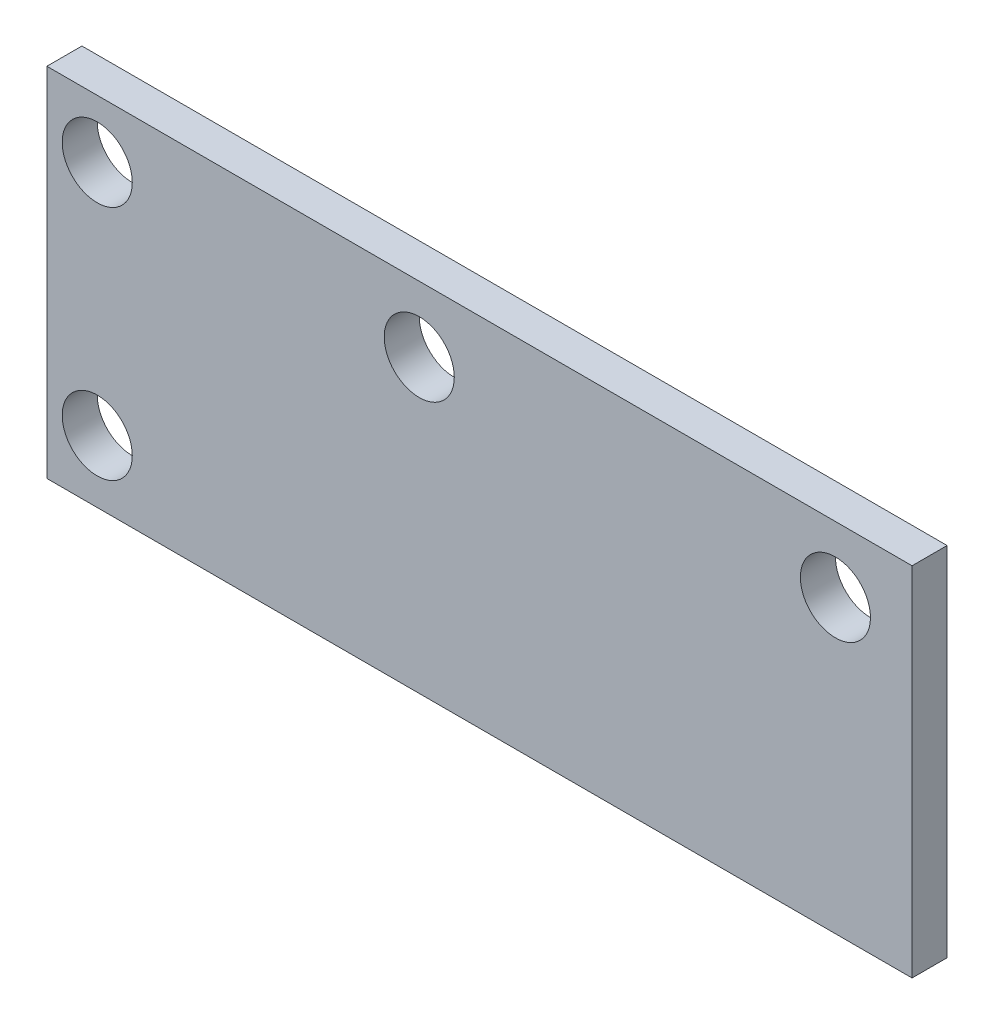
ISO-10303-21;
HEADER;
FILE_DESCRIPTION(('STEP AP214'),'2;1');
FILE_NAME('part.step','',(''),(''),'','','');
FILE_SCHEMA(('AUTOMOTIVE_DESIGN { 1 0 10303 214 1 1 1 1 }'));
ENDSEC;
DATA;
#1=APPLICATION_CONTEXT('core data for automotive mechanical design processes');
#2=APPLICATION_PROTOCOL_DEFINITION('international standard','automotive_design',2000,#1);
#3=PRODUCT_CONTEXT('',#1,'mechanical');
#4=PRODUCT('Part','Part','',(#3));
#5=PRODUCT_RELATED_PRODUCT_CATEGORY('part','',(#4));
#6=PRODUCT_DEFINITION_FORMATION('','',#4);
#7=PRODUCT_DEFINITION_CONTEXT('part definition',#1,'design');
#8=PRODUCT_DEFINITION('design','',#6,#7);
#9=PRODUCT_DEFINITION_SHAPE('','',#8);
#10=(LENGTH_UNIT() NAMED_UNIT(*) SI_UNIT(.MILLI.,.METRE.));
#11=(NAMED_UNIT(*) PLANE_ANGLE_UNIT() SI_UNIT($,.RADIAN.));
#12=(NAMED_UNIT(*) SI_UNIT($,.STERADIAN.) SOLID_ANGLE_UNIT());
#13=UNCERTAINTY_MEASURE_WITH_UNIT(LENGTH_MEASURE(1.E-05),#10,'distance_accuracy_value','');
#14=(GEOMETRIC_REPRESENTATION_CONTEXT(3) GLOBAL_UNCERTAINTY_ASSIGNED_CONTEXT((#13)) GLOBAL_UNIT_ASSIGNED_CONTEXT((#10,
#11,#12)) REPRESENTATION_CONTEXT('',''));
#15=CARTESIAN_POINT('',(0.,0.,0.));
#16=DIRECTION('',(0.,0.,1.));
#17=DIRECTION('',(1.,0.,0.));
#18=AXIS2_PLACEMENT_3D('',#15,#16,#17);
#19=CARTESIAN_POINT('',(19.75,-8.15,1.6));
#20=DIRECTION('',(-1.,0.,0.));
#21=DIRECTION('',(0.,0.,1.));
#22=AXIS2_PLACEMENT_3D('',#19,#20,#21);
#23=PLANE('',#22);
#24=DIRECTION('',(0.,1.,0.));
#25=VECTOR('',#24,1.);
#26=CARTESIAN_POINT('',(19.75,-8.15,0.));
#27=LINE('',#26,#25);
#28=CARTESIAN_POINT('',(19.75,-8.15,0.));
#29=VERTEX_POINT('',#28);
#30=CARTESIAN_POINT('',(19.75,8.15,0.));
#31=VERTEX_POINT('',#30);
#32=EDGE_CURVE('E97',#29,#31,#27,.T.);
#33=ORIENTED_EDGE('',*,*,#32,.T.);
#34=DIRECTION('',(0.,0.,-1.));
#35=VECTOR('',#34,1.);
#36=CARTESIAN_POINT('',(19.75,8.15,1.6));
#37=LINE('',#36,#35);
#38=CARTESIAN_POINT('',(19.75,8.15,1.6));
#39=VERTEX_POINT('',#38);
#40=EDGE_CURVE('E11',#39,#31,#37,.T.);
#41=ORIENTED_EDGE('',*,*,#40,.F.);
#42=DIRECTION('',(0.,1.,0.));
#43=VECTOR('',#42,1.);
#44=CARTESIAN_POINT('',(19.75,-8.15,1.6));
#45=LINE('',#44,#43);
#46=CARTESIAN_POINT('',(19.75,-8.15,1.6));
#47=VERTEX_POINT('',#46);
#48=EDGE_CURVE('E85',#47,#39,#45,.T.);
#49=ORIENTED_EDGE('',*,*,#48,.F.);
#50=DIRECTION('',(0.,0.,-1.));
#51=VECTOR('',#50,1.);
#52=CARTESIAN_POINT('',(19.75,-8.15,1.6));
#53=LINE('',#52,#51);
#54=EDGE_CURVE('E93',#47,#29,#53,.T.);
#55=ORIENTED_EDGE('',*,*,#54,.T.);
#56=EDGE_LOOP('',(#33,#41,#49,#55));
#57=FACE_BOUND('',#56,.T.);
#58=ADVANCED_FACE('F34',(#57),#23,.F.);
#59=CARTESIAN_POINT('',(-19.75,8.15,1.6));
#60=DIRECTION('',(0.,-1.,0.));
#61=DIRECTION('',(0.,0.,-1.));
#62=AXIS2_PLACEMENT_3D('',#59,#60,#61);
#63=PLANE('',#62);
#64=DIRECTION('',(-1.,0.,0.));
#65=VECTOR('',#64,1.);
#66=CARTESIAN_POINT('',(-19.75,8.15,0.));
#67=LINE('',#66,#65);
#68=CARTESIAN_POINT('',(-19.75,8.15,0.));
#69=VERTEX_POINT('',#68);
#70=EDGE_CURVE('E89',#31,#69,#67,.T.);
#71=ORIENTED_EDGE('',*,*,#70,.T.);
#72=DIRECTION('',(0.,0.,-1.));
#73=VECTOR('',#72,1.);
#74=CARTESIAN_POINT('',(-19.75,8.15,1.6));
#75=LINE('',#74,#73);
#76=CARTESIAN_POINT('',(-19.75,8.15,1.6));
#77=VERTEX_POINT('',#76);
#78=EDGE_CURVE('E42',#77,#69,#75,.T.);
#79=ORIENTED_EDGE('',*,*,#78,.F.);
#80=DIRECTION('',(-1.,0.,0.));
#81=VECTOR('',#80,1.);
#82=CARTESIAN_POINT('',(-19.75,8.15,1.6));
#83=LINE('',#82,#81);
#84=EDGE_CURVE('E80',#39,#77,#83,.T.);
#85=ORIENTED_EDGE('',*,*,#84,.F.);
#86=ORIENTED_EDGE('',*,*,#40,.T.);
#87=EDGE_LOOP('',(#71,#79,#85,#86));
#88=FACE_BOUND('',#87,.T.);
#89=ADVANCED_FACE('F88',(#88),#63,.F.);
#90=CARTESIAN_POINT('',(-19.75,-8.15,1.6));
#91=DIRECTION('',(1.,0.,0.));
#92=DIRECTION('',(0.,0.,-1.));
#93=AXIS2_PLACEMENT_3D('',#90,#91,#92);
#94=PLANE('',#93);
#95=DIRECTION('',(0.,-1.,0.));
#96=VECTOR('',#95,1.);
#97=CARTESIAN_POINT('',(-19.75,-8.15,0.));
#98=LINE('',#97,#96);
#99=CARTESIAN_POINT('',(-19.75,-8.15,0.));
#100=VERTEX_POINT('',#99);
#101=EDGE_CURVE('E67',#69,#100,#98,.T.);
#102=ORIENTED_EDGE('',*,*,#101,.T.);
#103=DIRECTION('',(0.,0.,-1.));
#104=VECTOR('',#103,1.);
#105=CARTESIAN_POINT('',(-19.75,-8.15,1.6));
#106=LINE('',#105,#104);
#107=CARTESIAN_POINT('',(-19.75,-8.15,1.6));
#108=VERTEX_POINT('',#107);
#109=EDGE_CURVE('E90',#108,#100,#106,.T.);
#110=ORIENTED_EDGE('',*,*,#109,.F.);
#111=DIRECTION('',(0.,-1.,0.));
#112=VECTOR('',#111,1.);
#113=CARTESIAN_POINT('',(-19.75,-8.15,1.6));
#114=LINE('',#113,#112);
#115=EDGE_CURVE('E83',#77,#108,#114,.T.);
#116=ORIENTED_EDGE('',*,*,#115,.F.);
#117=ORIENTED_EDGE('',*,*,#78,.T.);
#118=EDGE_LOOP('',(#102,#110,#116,#117));
#119=FACE_BOUND('',#118,.T.);
#120=ADVANCED_FACE('F91',(#119),#94,.F.);
#121=CARTESIAN_POINT('',(-19.75,-8.15,1.6));
#122=DIRECTION('',(0.,1.,0.));
#123=DIRECTION('',(0.,0.,1.));
#124=AXIS2_PLACEMENT_3D('',#121,#122,#123);
#125=PLANE('',#124);
#126=DIRECTION('',(1.,0.,0.));
#127=VECTOR('',#126,1.);
#128=CARTESIAN_POINT('',(-19.75,-8.15,0.));
#129=LINE('',#128,#127);
#130=EDGE_CURVE('E73',#100,#29,#129,.T.);
#131=ORIENTED_EDGE('',*,*,#130,.T.);
#132=ORIENTED_EDGE('',*,*,#54,.F.);
#133=DIRECTION('',(1.,0.,0.));
#134=VECTOR('',#133,1.);
#135=CARTESIAN_POINT('',(-19.75,-8.15,1.6));
#136=LINE('',#135,#134);
#137=EDGE_CURVE('E50',#108,#47,#136,.T.);
#138=ORIENTED_EDGE('',*,*,#137,.F.);
#139=ORIENTED_EDGE('',*,*,#109,.T.);
#140=EDGE_LOOP('',(#131,#132,#138,#139));
#141=FACE_BOUND('',#140,.T.);
#142=ADVANCED_FACE('F105',(#141),#125,.F.);
#143=CARTESIAN_POINT('',(0.,0.,1.6));
#144=DIRECTION('',(0.,0.,-1.));
#145=DIRECTION('',(-1.,0.,0.));
#146=AXIS2_PLACEMENT_3D('',#143,#144,#145);
#147=PLANE('',#146);
#148=CARTESIAN_POINT('',(-17.4514610210143,-5.3,1.6));
#149=DIRECTION('',(0.,0.,1.));
#150=DIRECTION('',(1.,0.,0.));
#151=AXIS2_PLACEMENT_3D('',#148,#149,#150);
#152=CIRCLE('',#151,1.6);
#153=CARTESIAN_POINT('',(-15.8514610210143,-5.3,1.6));
#154=VERTEX_POINT('',#153);
#155=EDGE_CURVE('E129',#154,#154,#152,.T.);
#156=ORIENTED_EDGE('',*,*,#155,.F.);
#157=EDGE_LOOP('',(#156));
#158=FACE_BOUND('',#157,.T.);
#159=CARTESIAN_POINT('',(-17.4514610210143,5.5,1.6));
#160=DIRECTION('',(0.,0.,1.));
#161=DIRECTION('',(1.,0.,0.));
#162=AXIS2_PLACEMENT_3D('',#159,#160,#161);
#163=CIRCLE('',#162,1.6);
#164=CARTESIAN_POINT('',(-15.8514610210143,5.5,1.6));
#165=VERTEX_POINT('',#164);
#166=EDGE_CURVE('E123',#165,#165,#163,.T.);
#167=ORIENTED_EDGE('',*,*,#166,.F.);
#168=EDGE_LOOP('',(#167));
#169=FACE_BOUND('',#168,.T.);
#170=CARTESIAN_POINT('',(16.25,5.15,1.6));
#171=DIRECTION('',(0.,0.,1.));
#172=DIRECTION('',(1.,0.,0.));
#173=AXIS2_PLACEMENT_3D('',#170,#171,#172);
#174=CIRCLE('',#173,1.6);
#175=CARTESIAN_POINT('',(17.85,5.15,1.6));
#176=VERTEX_POINT('',#175);
#177=EDGE_CURVE('E117',#176,#176,#174,.T.);
#178=ORIENTED_EDGE('',*,*,#177,.F.);
#179=EDGE_LOOP('',(#178));
#180=FACE_BOUND('',#179,.T.);
#181=CARTESIAN_POINT('',(-2.75000000000001,5.15,1.6));
#182=DIRECTION('',(0.,0.,1.));
#183=DIRECTION('',(1.,0.,0.));
#184=AXIS2_PLACEMENT_3D('',#181,#182,#183);
#185=CIRCLE('',#184,1.6);
#186=CARTESIAN_POINT('',(-1.15000000000001,5.15,1.6));
#187=VERTEX_POINT('',#186);
#188=EDGE_CURVE('E111',#187,#187,#185,.T.);
#189=ORIENTED_EDGE('',*,*,#188,.F.);
#190=EDGE_LOOP('',(#189));
#191=FACE_BOUND('',#190,.T.);
#192=ORIENTED_EDGE('',*,*,#48,.T.);
#193=ORIENTED_EDGE('',*,*,#84,.T.);
#194=ORIENTED_EDGE('',*,*,#115,.T.);
#195=ORIENTED_EDGE('',*,*,#137,.T.);
#196=EDGE_LOOP('',(#192,#193,#194,#195));
#197=FACE_BOUND('',#196,.T.);
#198=ADVANCED_FACE('F81',(#158,#169,#180,#191,#197),#147,.F.);
#199=CARTESIAN_POINT('',(0.,0.,0.));
#200=DIRECTION('',(0.,0.,-1.));
#201=DIRECTION('',(-1.,0.,0.));
#202=AXIS2_PLACEMENT_3D('',#199,#200,#201);
#203=PLANE('',#202);
#204=CARTESIAN_POINT('',(-17.4514610210143,-5.3,0.));
#205=DIRECTION('',(0.,0.,1.));
#206=DIRECTION('',(1.,0.,0.));
#207=AXIS2_PLACEMENT_3D('',#204,#205,#206);
#208=CIRCLE('',#207,1.6);
#209=CARTESIAN_POINT('',(-15.8514610210143,-5.3,0.));
#210=VERTEX_POINT('',#209);
#211=EDGE_CURVE('E126',#210,#210,#208,.T.);
#212=ORIENTED_EDGE('',*,*,#211,.T.);
#213=EDGE_LOOP('',(#212));
#214=FACE_BOUND('',#213,.T.);
#215=CARTESIAN_POINT('',(-17.4514610210143,5.5,0.));
#216=DIRECTION('',(0.,0.,1.));
#217=DIRECTION('',(1.,0.,0.));
#218=AXIS2_PLACEMENT_3D('',#215,#216,#217);
#219=CIRCLE('',#218,1.6);
#220=CARTESIAN_POINT('',(-15.8514610210143,5.5,0.));
#221=VERTEX_POINT('',#220);
#222=EDGE_CURVE('E120',#221,#221,#219,.T.);
#223=ORIENTED_EDGE('',*,*,#222,.T.);
#224=EDGE_LOOP('',(#223));
#225=FACE_BOUND('',#224,.T.);
#226=CARTESIAN_POINT('',(16.25,5.15,0.));
#227=DIRECTION('',(0.,0.,1.));
#228=DIRECTION('',(1.,0.,0.));
#229=AXIS2_PLACEMENT_3D('',#226,#227,#228);
#230=CIRCLE('',#229,1.6);
#231=CARTESIAN_POINT('',(17.85,5.15,0.));
#232=VERTEX_POINT('',#231);
#233=EDGE_CURVE('E114',#232,#232,#230,.T.);
#234=ORIENTED_EDGE('',*,*,#233,.T.);
#235=EDGE_LOOP('',(#234));
#236=FACE_BOUND('',#235,.T.);
#237=CARTESIAN_POINT('',(-2.75000000000001,5.15,0.));
#238=DIRECTION('',(0.,0.,1.));
#239=DIRECTION('',(1.,0.,0.));
#240=AXIS2_PLACEMENT_3D('',#237,#238,#239);
#241=CIRCLE('',#240,1.6);
#242=CARTESIAN_POINT('',(-1.15000000000001,5.15,0.));
#243=VERTEX_POINT('',#242);
#244=EDGE_CURVE('E100',#243,#243,#241,.T.);
#245=ORIENTED_EDGE('',*,*,#244,.T.);
#246=EDGE_LOOP('',(#245));
#247=FACE_BOUND('',#246,.T.);
#248=ORIENTED_EDGE('',*,*,#32,.F.);
#249=ORIENTED_EDGE('',*,*,#130,.F.);
#250=ORIENTED_EDGE('',*,*,#101,.F.);
#251=ORIENTED_EDGE('',*,*,#70,.F.);
#252=EDGE_LOOP('',(#248,#249,#250,#251));
#253=FACE_BOUND('',#252,.T.);
#254=ADVANCED_FACE('F108',(#214,#225,#236,#247,#253),#203,.T.);
#255=CARTESIAN_POINT('',(-2.75000000000001,5.15,0.));
#256=DIRECTION('',(0.,0.,1.));
#257=DIRECTION('',(1.,0.,0.));
#258=AXIS2_PLACEMENT_3D('',#255,#256,#257);
#259=CYLINDRICAL_SURFACE('',#258,1.6);
#260=ORIENTED_EDGE('',*,*,#244,.F.);
#261=EDGE_LOOP('',(#260));
#262=FACE_BOUND('',#261,.T.);
#263=ORIENTED_EDGE('',*,*,#188,.T.);
#264=EDGE_LOOP('',(#263));
#265=FACE_BOUND('',#264,.T.);
#266=ADVANCED_FACE('F153',(#262,#265),#259,.F.);
#267=CARTESIAN_POINT('',(16.25,5.15,0.));
#268=DIRECTION('',(0.,0.,1.));
#269=DIRECTION('',(1.,0.,0.));
#270=AXIS2_PLACEMENT_3D('',#267,#268,#269);
#271=CYLINDRICAL_SURFACE('',#270,1.6);
#272=ORIENTED_EDGE('',*,*,#233,.F.);
#273=EDGE_LOOP('',(#272));
#274=FACE_BOUND('',#273,.T.);
#275=ORIENTED_EDGE('',*,*,#177,.T.);
#276=EDGE_LOOP('',(#275));
#277=FACE_BOUND('',#276,.T.);
#278=ADVANCED_FACE('F155',(#274,#277),#271,.F.);
#279=CARTESIAN_POINT('',(-17.4514610210143,5.5,0.));
#280=DIRECTION('',(0.,0.,1.));
#281=DIRECTION('',(1.,0.,0.));
#282=AXIS2_PLACEMENT_3D('',#279,#280,#281);
#283=CYLINDRICAL_SURFACE('',#282,1.6);
#284=ORIENTED_EDGE('',*,*,#222,.F.);
#285=EDGE_LOOP('',(#284));
#286=FACE_BOUND('',#285,.T.);
#287=ORIENTED_EDGE('',*,*,#166,.T.);
#288=EDGE_LOOP('',(#287));
#289=FACE_BOUND('',#288,.T.);
#290=ADVANCED_FACE('F140',(#286,#289),#283,.F.);
#291=CARTESIAN_POINT('',(-17.4514610210143,-5.3,0.));
#292=DIRECTION('',(0.,0.,1.));
#293=DIRECTION('',(1.,0.,0.));
#294=AXIS2_PLACEMENT_3D('',#291,#292,#293);
#295=CYLINDRICAL_SURFACE('',#294,1.6);
#296=ORIENTED_EDGE('',*,*,#211,.F.);
#297=EDGE_LOOP('',(#296));
#298=FACE_BOUND('',#297,.T.);
#299=ORIENTED_EDGE('',*,*,#155,.T.);
#300=EDGE_LOOP('',(#299));
#301=FACE_BOUND('',#300,.T.);
#302=ADVANCED_FACE('F137',(#298,#301),#295,.F.);
#303=CLOSED_SHELL('',(#58,#89,#120,#142,#198,#254,#266,#278,#290,#302));
#304=MANIFOLD_SOLID_BREP('B2',#303);
#305=ADVANCED_BREP_SHAPE_REPRESENTATION('',(#18,#304),#14);
#306=SHAPE_DEFINITION_REPRESENTATION(#9,#305);
ENDSEC;
END-ISO-10303-21;
